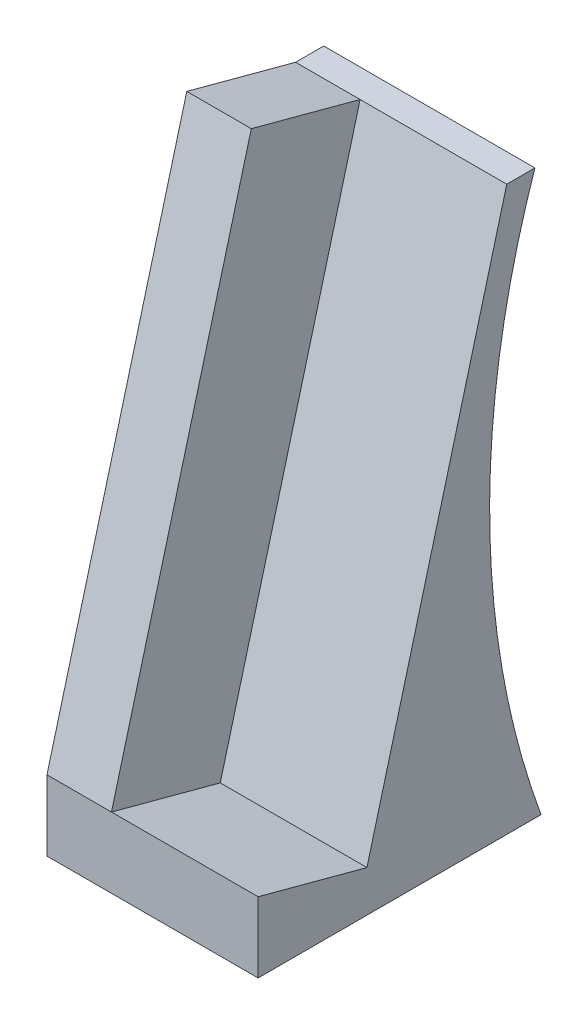
ISO-10303-21;
HEADER;
FILE_DESCRIPTION(('STEP AP214'),'2;1');
FILE_NAME('part.step','',(''),(''),'','','');
FILE_SCHEMA(('AUTOMOTIVE_DESIGN { 1 0 10303 214 1 1 1 1 }'));
ENDSEC;
DATA;
#1=APPLICATION_CONTEXT('core data for automotive mechanical design processes');
#2=APPLICATION_PROTOCOL_DEFINITION('international standard','automotive_design',2000,#1);
#3=PRODUCT_CONTEXT('',#1,'mechanical');
#4=PRODUCT('Part','Part','',(#3));
#5=PRODUCT_RELATED_PRODUCT_CATEGORY('part','',(#4));
#6=PRODUCT_DEFINITION_FORMATION('','',#4);
#7=PRODUCT_DEFINITION_CONTEXT('part definition',#1,'design');
#8=PRODUCT_DEFINITION('design','',#6,#7);
#9=PRODUCT_DEFINITION_SHAPE('','',#8);
#10=(LENGTH_UNIT() NAMED_UNIT(*) SI_UNIT(.MILLI.,.METRE.));
#11=(NAMED_UNIT(*) PLANE_ANGLE_UNIT() SI_UNIT($,.RADIAN.));
#12=(NAMED_UNIT(*) SI_UNIT($,.STERADIAN.) SOLID_ANGLE_UNIT());
#13=UNCERTAINTY_MEASURE_WITH_UNIT(LENGTH_MEASURE(1.E-05),#10,'distance_accuracy_value','');
#14=(GEOMETRIC_REPRESENTATION_CONTEXT(3) GLOBAL_UNCERTAINTY_ASSIGNED_CONTEXT((#13)) GLOBAL_UNIT_ASSIGNED_CONTEXT((#10,
#11,#12)) REPRESENTATION_CONTEXT('',''));
#15=CARTESIAN_POINT('',(0.,0.,0.));
#16=DIRECTION('',(0.,0.,1.));
#17=DIRECTION('',(1.,0.,0.));
#18=AXIS2_PLACEMENT_3D('',#15,#16,#17);
#19=CARTESIAN_POINT('',(-38.1,7.44079700351684,-19.6276127901939));
#20=DIRECTION('',(0.,-0.258819045102514,-0.96592582628907));
#21=DIRECTION('',(0.,0.96592582628907,-0.258819045102514));
#22=AXIS2_PLACEMENT_3D('',#19,#20,#21);
#23=PLANE('',#22);
#24=DIRECTION('',(0.,-0.96592582628907,0.258819045102514));
#25=VECTOR('',#24,1.);
#26=CARTESIAN_POINT('',(-26.4595011753954,101.6,-44.857495193059));
#27=LINE('',#26,#25);
#28=CARTESIAN_POINT('',(-26.4595011753954,101.6,-44.857495193059));
#29=VERTEX_POINT('',#28);
#30=CARTESIAN_POINT('',(-26.4595011753954,7.44079700351687,-19.6276127901939));
#31=VERTEX_POINT('',#30);
#32=EDGE_CURVE('E119',#29,#31,#27,.T.);
#33=ORIENTED_EDGE('',*,*,#32,.T.);
#34=DIRECTION('',(1.,0.,0.));
#35=VECTOR('',#34,1.);
#36=CARTESIAN_POINT('',(-38.1,7.44079700351684,-19.6276127901939));
#37=LINE('',#36,#35);
#38=CARTESIAN_POINT('',(0.,7.44079700351684,-19.6276127901939));
#39=VERTEX_POINT('',#38);
#40=EDGE_CURVE('E126',#31,#39,#37,.T.);
#41=ORIENTED_EDGE('',*,*,#40,.T.);
#42=DIRECTION('',(0.,-0.96592582628907,0.258819045102514));
#43=VECTOR('',#42,1.);
#44=CARTESIAN_POINT('',(0.,7.44079700351684,-19.6276127901939));
#45=LINE('',#44,#43);
#46=CARTESIAN_POINT('',(0.,101.6,-44.857495193059));
#47=VERTEX_POINT('',#46);
#48=EDGE_CURVE('E153',#47,#39,#45,.T.);
#49=ORIENTED_EDGE('',*,*,#48,.F.);
#50=DIRECTION('',(1.,0.,0.));
#51=VECTOR('',#50,1.);
#52=CARTESIAN_POINT('',(-38.1,101.6,-44.857495193059));
#53=LINE('',#52,#51);
#54=EDGE_CURVE('E157',#29,#47,#53,.T.);
#55=ORIENTED_EDGE('',*,*,#54,.F.);
#56=EDGE_LOOP('',(#33,#41,#49,#55));
#57=FACE_BOUND('',#56,.T.);
#58=ADVANCED_FACE('F35',(#57),#23,.F.);
#59=CARTESIAN_POINT('',(-38.1,12.7,0.));
#60=DIRECTION('',(0.,-0.965925826289069,0.258819045102518));
#61=DIRECTION('',(0.,-0.258819045102518,-0.965925826289069));
#62=AXIS2_PLACEMENT_3D('',#59,#60,#61);
#63=PLANE('',#62);
#64=DIRECTION('',(0.,-0.258819045102514,-0.96592582628907));
#65=VECTOR('',#64,1.);
#66=CARTESIAN_POINT('',(-26.4595011753954,12.7,0.));
#67=LINE('',#66,#65);
#68=CARTESIAN_POINT('',(-26.4595011753954,12.7,0.));
#69=VERTEX_POINT('',#68);
#70=EDGE_CURVE('E115',#69,#31,#67,.T.);
#71=ORIENTED_EDGE('',*,*,#70,.F.);
#72=DIRECTION('',(1.,0.,0.));
#73=VECTOR('',#72,1.);
#74=CARTESIAN_POINT('',(-38.1,12.7,0.));
#75=LINE('',#74,#73);
#76=CARTESIAN_POINT('',(0.,12.7,0.));
#77=VERTEX_POINT('',#76);
#78=EDGE_CURVE('E127',#69,#77,#75,.T.);
#79=ORIENTED_EDGE('',*,*,#78,.T.);
#80=DIRECTION('',(0.,0.258819045102518,0.965925826289069));
#81=VECTOR('',#80,1.);
#82=CARTESIAN_POINT('',(0.,12.7,0.));
#83=LINE('',#82,#81);
#84=EDGE_CURVE('E76',#39,#77,#83,.T.);
#85=ORIENTED_EDGE('',*,*,#84,.F.);
#86=ORIENTED_EDGE('',*,*,#40,.F.);
#87=EDGE_LOOP('',(#71,#79,#85,#86));
#88=FACE_BOUND('',#87,.T.);
#89=ADVANCED_FACE('F129',(#88),#63,.F.);
#90=CARTESIAN_POINT('',(-38.1,12.7,0.));
#91=DIRECTION('',(0.,0.,-1.));
#92=DIRECTION('',(0.,1.,0.));
#93=AXIS2_PLACEMENT_3D('',#90,#91,#92);
#94=PLANE('',#93);
#95=DIRECTION('',(0.,-1.,0.));
#96=VECTOR('',#95,1.);
#97=CARTESIAN_POINT('',(0.,12.7,0.));
#98=LINE('',#97,#96);
#99=CARTESIAN_POINT('',(0.,0.,0.));
#100=VERTEX_POINT('',#99);
#101=EDGE_CURVE('E82',#77,#100,#98,.T.);
#102=ORIENTED_EDGE('',*,*,#101,.F.);
#103=ORIENTED_EDGE('',*,*,#78,.F.);
#104=CARTESIAN_POINT('',(-38.1,12.7,0.));
#105=VERTEX_POINT('',#104);
#106=EDGE_CURVE('E122',#105,#69,#75,.T.);
#107=ORIENTED_EDGE('',*,*,#106,.F.);
#108=DIRECTION('',(0.,-1.,0.));
#109=VECTOR('',#108,1.);
#110=CARTESIAN_POINT('',(-38.1,12.7,0.));
#111=LINE('',#110,#109);
#112=CARTESIAN_POINT('',(-38.1,0.,0.));
#113=VERTEX_POINT('',#112);
#114=EDGE_CURVE('E139',#105,#113,#111,.T.);
#115=ORIENTED_EDGE('',*,*,#114,.T.);
#116=DIRECTION('',(1.,0.,0.));
#117=VECTOR('',#116,1.);
#118=CARTESIAN_POINT('',(-38.1,0.,0.));
#119=LINE('',#118,#117);
#120=EDGE_CURVE('E11',#113,#100,#119,.T.);
#121=ORIENTED_EDGE('',*,*,#120,.T.);
#122=EDGE_LOOP('',(#102,#103,#107,#115,#121));
#123=FACE_BOUND('',#122,.T.);
#124=ADVANCED_FACE('F37',(#123),#94,.F.);
#125=CARTESIAN_POINT('',(-38.1,0.,0.));
#126=DIRECTION('',(0.,1.,0.));
#127=DIRECTION('',(0.,0.,1.));
#128=AXIS2_PLACEMENT_3D('',#125,#126,#127);
#129=PLANE('',#128);
#130=DIRECTION('',(0.,0.,-1.));
#131=VECTOR('',#130,1.);
#132=CARTESIAN_POINT('',(0.,0.,0.));
#133=LINE('',#132,#131);
#134=CARTESIAN_POINT('',(0.,0.,-51.0442339810043));
#135=VERTEX_POINT('',#134);
#136=EDGE_CURVE('E134',#100,#135,#133,.T.);
#137=ORIENTED_EDGE('',*,*,#136,.F.);
#138=ORIENTED_EDGE('',*,*,#120,.F.);
#139=DIRECTION('',(0.,0.,-1.));
#140=VECTOR('',#139,1.);
#141=CARTESIAN_POINT('',(-38.1,0.,0.));
#142=LINE('',#141,#140);
#143=CARTESIAN_POINT('',(-38.1,0.,-51.0442339810043));
#144=VERTEX_POINT('',#143);
#145=EDGE_CURVE('E86',#113,#144,#142,.T.);
#146=ORIENTED_EDGE('',*,*,#145,.T.);
#147=DIRECTION('',(1.,0.,0.));
#148=VECTOR('',#147,1.);
#149=CARTESIAN_POINT('',(-38.1,0.,-51.0442339810043));
#150=LINE('',#149,#148);
#151=EDGE_CURVE('E44',#144,#135,#150,.T.);
#152=ORIENTED_EDGE('',*,*,#151,.T.);
#153=EDGE_LOOP('',(#137,#138,#146,#152));
#154=FACE_BOUND('',#153,.T.);
#155=ADVANCED_FACE('F166',(#154),#129,.F.);
#156=CARTESIAN_POINT('',(-38.1,52.3650605442912,-194.165373000342));
#157=DIRECTION('',(1.,0.,0.));
#158=DIRECTION('',(0.,0.,1.));
#159=AXIS2_PLACEMENT_3D('',#156,#157,#158);
#160=CYLINDRICAL_SURFACE('',#159,152.4);
#161=CARTESIAN_POINT('',(0.,52.3650605442912,-194.165373000342));
#162=DIRECTION('',(-1.,0.,0.));
#163=DIRECTION('',(0.,0.,-1.));
#164=AXIS2_PLACEMENT_3D('',#161,#162,#163);
#165=CIRCLE('',#164,152.4);
#166=CARTESIAN_POINT('',(0.,101.6,-49.937495193059));
#167=VERTEX_POINT('',#166);
#168=EDGE_CURVE('E148',#135,#167,#165,.T.);
#169=ORIENTED_EDGE('',*,*,#168,.F.);
#170=ORIENTED_EDGE('',*,*,#151,.F.);
#171=CARTESIAN_POINT('',(-38.1,52.3650605442912,-194.165373000342));
#172=DIRECTION('',(-1.,0.,0.));
#173=DIRECTION('',(0.,0.,-1.));
#174=AXIS2_PLACEMENT_3D('',#171,#172,#173);
#175=CIRCLE('',#174,152.4);
#176=CARTESIAN_POINT('',(-38.1,101.6,-49.937495193059));
#177=VERTEX_POINT('',#176);
#178=EDGE_CURVE('E142',#144,#177,#175,.T.);
#179=ORIENTED_EDGE('',*,*,#178,.T.);
#180=DIRECTION('',(1.,0.,0.));
#181=VECTOR('',#180,1.);
#182=CARTESIAN_POINT('',(-38.1,101.6,-49.937495193059));
#183=LINE('',#182,#181);
#184=EDGE_CURVE('E161',#177,#167,#183,.T.);
#185=ORIENTED_EDGE('',*,*,#184,.T.);
#186=EDGE_LOOP('',(#169,#170,#179,#185));
#187=FACE_BOUND('',#186,.T.);
#188=ADVANCED_FACE('F185',(#187),#160,.F.);
#189=CARTESIAN_POINT('',(-38.1,101.6,-44.857495193059));
#190=DIRECTION('',(0.,-1.,0.));
#191=DIRECTION('',(0.,0.,-1.));
#192=AXIS2_PLACEMENT_3D('',#189,#190,#191);
#193=PLANE('',#192);
#194=DIRECTION('',(0.,0.,1.));
#195=VECTOR('',#194,1.);
#196=CARTESIAN_POINT('',(0.,101.6,-44.857495193059));
#197=LINE('',#196,#195);
#198=EDGE_CURVE('E151',#167,#47,#197,.T.);
#199=ORIENTED_EDGE('',*,*,#198,.F.);
#200=ORIENTED_EDGE('',*,*,#184,.F.);
#201=DIRECTION('',(0.,0.,1.));
#202=VECTOR('',#201,1.);
#203=CARTESIAN_POINT('',(-38.1,101.6,-44.857495193059));
#204=LINE('',#203,#202);
#205=CARTESIAN_POINT('',(-38.1,101.6,-44.857495193059));
#206=VERTEX_POINT('',#205);
#207=EDGE_CURVE('E52',#177,#206,#204,.T.);
#208=ORIENTED_EDGE('',*,*,#207,.T.);
#209=EDGE_CURVE('E158',#206,#29,#53,.T.);
#210=ORIENTED_EDGE('',*,*,#209,.T.);
#211=ORIENTED_EDGE('',*,*,#54,.T.);
#212=EDGE_LOOP('',(#199,#200,#208,#210,#211));
#213=FACE_BOUND('',#212,.T.);
#214=ADVANCED_FACE('F184',(#213),#193,.F.);
#215=CARTESIAN_POINT('',(-38.1,52.3650605442912,-194.165373000342));
#216=DIRECTION('',(-1.,0.,0.));
#217=DIRECTION('',(0.,0.,-1.));
#218=AXIS2_PLACEMENT_3D('',#215,#216,#217);
#219=PLANE('',#218);
#220=DIRECTION('',(0.,0.96592582628907,-0.258819045102514));
#221=VECTOR('',#220,1.);
#222=CARTESIAN_POINT('',(-38.1,106.859202996483,-25.2298824028651));
#223=LINE('',#222,#221);
#224=CARTESIAN_POINT('',(-38.1,106.859202996483,-25.2298824028651));
#225=VERTEX_POINT('',#224);
#226=EDGE_CURVE('E118',#105,#225,#223,.T.);
#227=ORIENTED_EDGE('',*,*,#226,.T.);
#228=DIRECTION('',(0.,-0.258819045102514,-0.96592582628907));
#229=VECTOR('',#228,1.);
#230=CARTESIAN_POINT('',(-38.1,106.859202996483,-25.2298824028651));
#231=LINE('',#230,#229);
#232=EDGE_CURVE('E132',#225,#206,#231,.T.);
#233=ORIENTED_EDGE('',*,*,#232,.T.);
#234=ORIENTED_EDGE('',*,*,#207,.F.);
#235=ORIENTED_EDGE('',*,*,#178,.F.);
#236=ORIENTED_EDGE('',*,*,#145,.F.);
#237=ORIENTED_EDGE('',*,*,#114,.F.);
#238=EDGE_LOOP('',(#227,#233,#234,#235,#236,#237));
#239=FACE_BOUND('',#238,.T.);
#240=ADVANCED_FACE('F181',(#239),#219,.T.);
#241=CARTESIAN_POINT('',(0.,52.3650605442912,-194.165373000342));
#242=DIRECTION('',(-1.,0.,0.));
#243=DIRECTION('',(0.,0.,-1.));
#244=AXIS2_PLACEMENT_3D('',#241,#242,#243);
#245=PLANE('',#244);
#246=ORIENTED_EDGE('',*,*,#101,.T.);
#247=ORIENTED_EDGE('',*,*,#136,.T.);
#248=ORIENTED_EDGE('',*,*,#168,.T.);
#249=ORIENTED_EDGE('',*,*,#198,.T.);
#250=ORIENTED_EDGE('',*,*,#48,.T.);
#251=ORIENTED_EDGE('',*,*,#84,.T.);
#252=EDGE_LOOP('',(#246,#247,#248,#249,#250,#251));
#253=FACE_BOUND('',#252,.T.);
#254=ADVANCED_FACE('F169',(#253),#245,.F.);
#255=CARTESIAN_POINT('',(-26.4595011753954,106.859202996483,-25.2298824028651));
#256=DIRECTION('',(-1.,0.,0.));
#257=DIRECTION('',(0.,1.,0.));
#258=AXIS2_PLACEMENT_3D('',#255,#256,#257);
#259=PLANE('',#258);
#260=ORIENTED_EDGE('',*,*,#32,.F.);
#261=DIRECTION('',(0.,-0.258819045102514,-0.96592582628907));
#262=VECTOR('',#261,1.);
#263=CARTESIAN_POINT('',(-26.4595011753954,106.859202996483,-25.2298824028651));
#264=LINE('',#263,#262);
#265=CARTESIAN_POINT('',(-26.4595011753954,106.859202996483,-25.2298824028651));
#266=VERTEX_POINT('',#265);
#267=EDGE_CURVE('E116',#266,#29,#264,.T.);
#268=ORIENTED_EDGE('',*,*,#267,.F.);
#269=DIRECTION('',(0.,-0.96592582628907,0.258819045102514));
#270=VECTOR('',#269,1.);
#271=CARTESIAN_POINT('',(-26.4595011753954,106.859202996483,-25.2298824028651));
#272=LINE('',#271,#270);
#273=EDGE_CURVE('E110',#266,#69,#272,.T.);
#274=ORIENTED_EDGE('',*,*,#273,.T.);
#275=ORIENTED_EDGE('',*,*,#70,.T.);
#276=EDGE_LOOP('',(#260,#268,#274,#275));
#277=FACE_BOUND('',#276,.T.);
#278=ADVANCED_FACE('F113',(#277),#259,.F.);
#279=CARTESIAN_POINT('',(-26.4595011753954,106.859202996483,-25.2298824028651));
#280=DIRECTION('',(0.,-0.96592582628907,0.258819045102514));
#281=DIRECTION('',(0.,-0.258819045102514,-0.96592582628907));
#282=AXIS2_PLACEMENT_3D('',#279,#280,#281);
#283=PLANE('',#282);
#284=ORIENTED_EDGE('',*,*,#209,.F.);
#285=ORIENTED_EDGE('',*,*,#232,.F.);
#286=DIRECTION('',(1.,0.,0.));
#287=VECTOR('',#286,1.);
#288=CARTESIAN_POINT('',(-26.4595011753954,106.859202996483,-25.2298824028651));
#289=LINE('',#288,#287);
#290=EDGE_CURVE('E176',#225,#266,#289,.T.);
#291=ORIENTED_EDGE('',*,*,#290,.T.);
#292=ORIENTED_EDGE('',*,*,#267,.T.);
#293=EDGE_LOOP('',(#284,#285,#291,#292));
#294=FACE_BOUND('',#293,.T.);
#295=ADVANCED_FACE('F182',(#294),#283,.F.);
#296=CARTESIAN_POINT('',(0.,0.85073868596877,3.17499999999991));
#297=DIRECTION('',(0.,0.258819045102514,0.96592582628907));
#298=DIRECTION('',(0.,-0.96592582628907,0.258819045102514));
#299=AXIS2_PLACEMENT_3D('',#296,#297,#298);
#300=PLANE('',#299);
#301=ORIENTED_EDGE('',*,*,#273,.F.);
#302=ORIENTED_EDGE('',*,*,#290,.F.);
#303=ORIENTED_EDGE('',*,*,#226,.F.);
#304=ORIENTED_EDGE('',*,*,#106,.T.);
#305=EDGE_LOOP('',(#301,#302,#303,#304));
#306=FACE_BOUND('',#305,.T.);
#307=ADVANCED_FACE('F123',(#306),#300,.T.);
#308=CLOSED_SHELL('',(#58,#89,#124,#155,#188,#214,#240,#254,#278,#295,#307));
#309=MANIFOLD_SOLID_BREP('B2',#308);
#310=ADVANCED_BREP_SHAPE_REPRESENTATION('',(#18,#309),#14);
#311=SHAPE_DEFINITION_REPRESENTATION(#9,#310);
ENDSEC;
END-ISO-10303-21;
